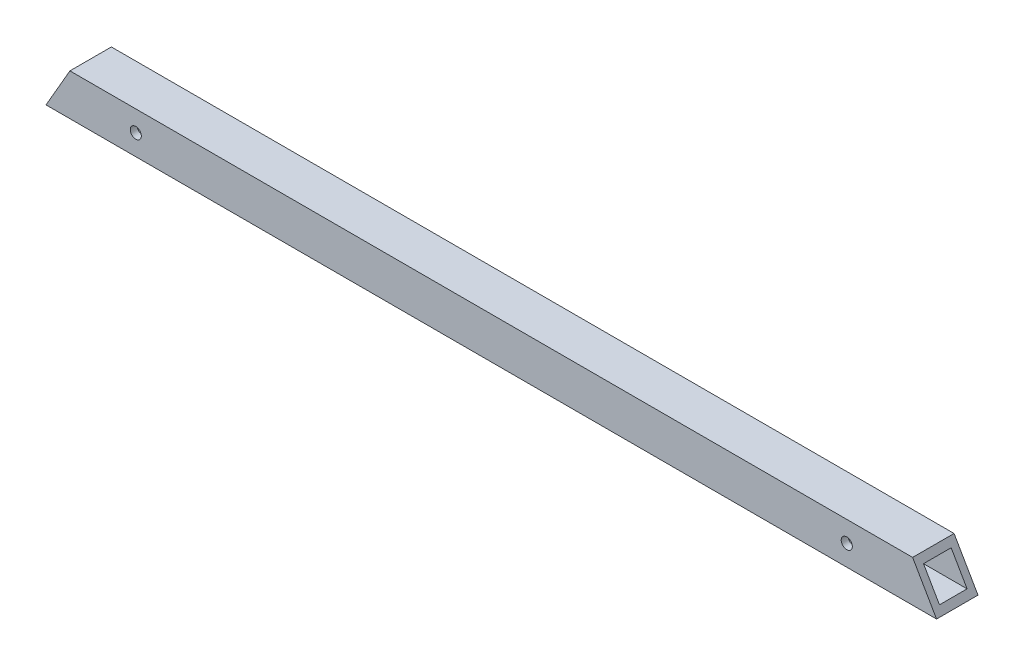
ISO-10303-21;
HEADER;
FILE_DESCRIPTION(('STEP AP214'),'2;1');
FILE_NAME('part.step','',(''),(''),'','','');
FILE_SCHEMA(('AUTOMOTIVE_DESIGN { 1 0 10303 214 1 1 1 1 }'));
ENDSEC;
DATA;
#1=APPLICATION_CONTEXT('core data for automotive mechanical design processes');
#2=APPLICATION_PROTOCOL_DEFINITION('international standard','automotive_design',2000,#1);
#3=PRODUCT_CONTEXT('',#1,'mechanical');
#4=PRODUCT('Part','Part','',(#3));
#5=PRODUCT_RELATED_PRODUCT_CATEGORY('part','',(#4));
#6=PRODUCT_DEFINITION_FORMATION('','',#4);
#7=PRODUCT_DEFINITION_CONTEXT('part definition',#1,'design');
#8=PRODUCT_DEFINITION('design','',#6,#7);
#9=PRODUCT_DEFINITION_SHAPE('','',#8);
#10=(LENGTH_UNIT() NAMED_UNIT(*) SI_UNIT(.MILLI.,.METRE.));
#11=(NAMED_UNIT(*) PLANE_ANGLE_UNIT() SI_UNIT($,.RADIAN.));
#12=(NAMED_UNIT(*) SI_UNIT($,.STERADIAN.) SOLID_ANGLE_UNIT());
#13=UNCERTAINTY_MEASURE_WITH_UNIT(LENGTH_MEASURE(1.E-05),#10,'distance_accuracy_value','');
#14=(GEOMETRIC_REPRESENTATION_CONTEXT(3) GLOBAL_UNCERTAINTY_ASSIGNED_CONTEXT((#13)) GLOBAL_UNIT_ASSIGNED_CONTEXT((#10,
#11,#12)) REPRESENTATION_CONTEXT('',''));
#15=CARTESIAN_POINT('',(0.,0.,0.));
#16=DIRECTION('',(0.,0.,1.));
#17=DIRECTION('',(1.,0.,0.));
#18=AXIS2_PLACEMENT_3D('',#15,#16,#17);
#19=CARTESIAN_POINT('',(431.8,0.,0.));
#20=DIRECTION('',(0.,0.,-1.));
#21=DIRECTION('',(-1.,0.,0.));
#22=AXIS2_PLACEMENT_3D('',#19,#20,#21);
#23=PLANE('',#22);
#24=CARTESIAN_POINT('',(368.072045256125,9.525,0.));
#25=DIRECTION('',(0.,0.,1.));
#26=DIRECTION('',(1.,0.,0.));
#27=AXIS2_PLACEMENT_3D('',#24,#25,#26);
#28=CIRCLE('',#27,2.55269999999996);
#29=CARTESIAN_POINT('',(370.624745256125,9.525,0.));
#30=VERTEX_POINT('',#29);
#31=EDGE_CURVE('E225',#30,#30,#28,.T.);
#32=ORIENTED_EDGE('',*,*,#31,.F.);
#33=EDGE_LOOP('',(#32));
#34=FACE_BOUND('',#33,.T.);
#35=CARTESIAN_POINT('',(41.275,9.525,0.));
#36=DIRECTION('',(0.,0.,1.));
#37=DIRECTION('',(1.,0.,0.));
#38=AXIS2_PLACEMENT_3D('',#35,#36,#37);
#39=CIRCLE('',#38,2.55269999999998);
#40=CARTESIAN_POINT('',(43.8277,9.525,0.));
#41=VERTEX_POINT('',#40);
#42=EDGE_CURVE('E140',#41,#41,#39,.T.);
#43=ORIENTED_EDGE('',*,*,#42,.F.);
#44=EDGE_LOOP('',(#43));
#45=FACE_BOUND('',#44,.T.);
#46=DIRECTION('',(-1.,0.,0.));
#47=VECTOR('',#46,1.);
#48=CARTESIAN_POINT('',(431.8,19.05,0.));
#49=LINE('',#48,#47);
#50=CARTESIAN_POINT('',(398.348522628062,19.05,0.));
#51=VERTEX_POINT('',#50);
#52=CARTESIAN_POINT('',(10.9985226280622,19.05,0.));
#53=VERTEX_POINT('',#52);
#54=EDGE_CURVE('E119',#51,#53,#49,.T.);
#55=ORIENTED_EDGE('',*,*,#54,.T.);
#56=DIRECTION('',(0.499999999999995,0.866025403784442,0.));
#57=VECTOR('',#56,1.);
#58=CARTESIAN_POINT('',(0.,0.,0.));
#59=LINE('',#58,#57);
#60=CARTESIAN_POINT('',(0.,0.,0.));
#61=VERTEX_POINT('',#60);
#62=EDGE_CURVE('E49',#61,#53,#59,.T.);
#63=ORIENTED_EDGE('',*,*,#62,.F.);
#64=DIRECTION('',(-1.,0.,0.));
#65=VECTOR('',#64,1.);
#66=CARTESIAN_POINT('',(431.8,0.,0.));
#67=LINE('',#66,#65);
#68=CARTESIAN_POINT('',(409.347045256125,0.,0.));
#69=VERTEX_POINT('',#68);
#70=EDGE_CURVE('E113',#69,#61,#67,.T.);
#71=ORIENTED_EDGE('',*,*,#70,.F.);
#72=DIRECTION('',(0.5,-0.866025403784439,0.));
#73=VECTOR('',#72,1.);
#74=CARTESIAN_POINT('',(307.010283942094,177.252470077951,0.));
#75=LINE('',#74,#73);
#76=EDGE_CURVE('E156',#51,#69,#75,.T.);
#77=ORIENTED_EDGE('',*,*,#76,.F.);
#78=EDGE_LOOP('',(#55,#63,#71,#77));
#79=FACE_BOUND('',#78,.T.);
#80=ADVANCED_FACE('F33',(#34,#45,#79),#23,.F.);
#81=CARTESIAN_POINT('',(431.8,0.,0.));
#82=DIRECTION('',(0.,1.,0.));
#83=DIRECTION('',(0.,0.,1.));
#84=AXIS2_PLACEMENT_3D('',#81,#82,#83);
#85=PLANE('',#84);
#86=DIRECTION('',(-1.,0.,0.));
#87=VECTOR('',#86,1.);
#88=CARTESIAN_POINT('',(431.8,0.,-19.05));
#89=LINE('',#88,#87);
#90=CARTESIAN_POINT('',(409.347045256125,0.,-19.05));
#91=VERTEX_POINT('',#90);
#92=CARTESIAN_POINT('',(0.,0.,-19.05));
#93=VERTEX_POINT('',#92);
#94=EDGE_CURVE('E108',#91,#93,#89,.T.);
#95=ORIENTED_EDGE('',*,*,#94,.F.);
#96=DIRECTION('',(0.,0.,1.));
#97=VECTOR('',#96,1.);
#98=CARTESIAN_POINT('',(409.347045256125,0.,-19.05));
#99=LINE('',#98,#97);
#100=EDGE_CURVE('E160',#91,#69,#99,.T.);
#101=ORIENTED_EDGE('',*,*,#100,.T.);
#102=ORIENTED_EDGE('',*,*,#70,.T.);
#103=DIRECTION('',(0.,0.,-1.));
#104=VECTOR('',#103,1.);
#105=CARTESIAN_POINT('',(0.,0.,0.));
#106=LINE('',#105,#104);
#107=EDGE_CURVE('E100',#61,#93,#106,.T.);
#108=ORIENTED_EDGE('',*,*,#107,.T.);
#109=EDGE_LOOP('',(#95,#101,#102,#108));
#110=FACE_BOUND('',#109,.T.);
#111=ADVANCED_FACE('F117',(#110),#85,.F.);
#112=CARTESIAN_POINT('',(431.8,0.,-19.05));
#113=DIRECTION('',(0.,0.,1.));
#114=DIRECTION('',(1.,0.,0.));
#115=AXIS2_PLACEMENT_3D('',#112,#113,#114);
#116=PLANE('',#115);
#117=CARTESIAN_POINT('',(368.072045256125,9.525,-19.05));
#118=DIRECTION('',(0.,0.,1.));
#119=DIRECTION('',(1.,0.,0.));
#120=AXIS2_PLACEMENT_3D('',#117,#118,#119);
#121=CIRCLE('',#120,2.55270000000002);
#122=CARTESIAN_POINT('',(370.624745256125,9.525,-19.05));
#123=VERTEX_POINT('',#122);
#124=EDGE_CURVE('E300',#123,#123,#121,.T.);
#125=ORIENTED_EDGE('',*,*,#124,.T.);
#126=EDGE_LOOP('',(#125));
#127=FACE_BOUND('',#126,.T.);
#128=CARTESIAN_POINT('',(41.275,9.525,-19.05));
#129=DIRECTION('',(0.,0.,1.));
#130=DIRECTION('',(1.,0.,0.));
#131=AXIS2_PLACEMENT_3D('',#128,#129,#130);
#132=CIRCLE('',#131,2.5527);
#133=CARTESIAN_POINT('',(43.8277,9.525,-19.05));
#134=VERTEX_POINT('',#133);
#135=EDGE_CURVE('E134',#134,#134,#132,.T.);
#136=ORIENTED_EDGE('',*,*,#135,.T.);
#137=EDGE_LOOP('',(#136));
#138=FACE_BOUND('',#137,.T.);
#139=ORIENTED_EDGE('',*,*,#94,.T.);
#140=DIRECTION('',(0.499999999999995,0.866025403784442,0.));
#141=VECTOR('',#140,1.);
#142=CARTESIAN_POINT('',(0.,0.,-19.05));
#143=LINE('',#142,#141);
#144=CARTESIAN_POINT('',(10.9985226280622,19.05,-19.05));
#145=VERTEX_POINT('',#144);
#146=EDGE_CURVE('E96',#93,#145,#143,.T.);
#147=ORIENTED_EDGE('',*,*,#146,.T.);
#148=DIRECTION('',(-1.,0.,0.));
#149=VECTOR('',#148,1.);
#150=CARTESIAN_POINT('',(431.8,19.05,-19.05));
#151=LINE('',#150,#149);
#152=CARTESIAN_POINT('',(398.348522628062,19.05,-19.05));
#153=VERTEX_POINT('',#152);
#154=EDGE_CURVE('E114',#153,#145,#151,.T.);
#155=ORIENTED_EDGE('',*,*,#154,.F.);
#156=DIRECTION('',(0.5,-0.866025403784439,0.));
#157=VECTOR('',#156,1.);
#158=CARTESIAN_POINT('',(307.010283942094,177.252470077951,-19.05));
#159=LINE('',#158,#157);
#160=EDGE_CURVE('E110',#153,#91,#159,.T.);
#161=ORIENTED_EDGE('',*,*,#160,.T.);
#162=EDGE_LOOP('',(#139,#147,#155,#161));
#163=FACE_BOUND('',#162,.T.);
#164=ADVANCED_FACE('F109',(#127,#138,#163),#116,.F.);
#165=CARTESIAN_POINT('',(431.8,19.05,0.));
#166=DIRECTION('',(0.,-1.,0.));
#167=DIRECTION('',(0.,0.,-1.));
#168=AXIS2_PLACEMENT_3D('',#165,#166,#167);
#169=PLANE('',#168);
#170=ORIENTED_EDGE('',*,*,#154,.T.);
#171=DIRECTION('',(0.,0.,1.));
#172=VECTOR('',#171,1.);
#173=CARTESIAN_POINT('',(10.9985226280622,19.05,-19.05));
#174=LINE('',#173,#172);
#175=EDGE_CURVE('E101',#145,#53,#174,.T.);
#176=ORIENTED_EDGE('',*,*,#175,.T.);
#177=ORIENTED_EDGE('',*,*,#54,.F.);
#178=DIRECTION('',(0.,0.,1.));
#179=VECTOR('',#178,1.);
#180=CARTESIAN_POINT('',(398.348522628062,19.05,-19.05));
#181=LINE('',#180,#179);
#182=EDGE_CURVE('E158',#153,#51,#181,.T.);
#183=ORIENTED_EDGE('',*,*,#182,.F.);
#184=EDGE_LOOP('',(#170,#176,#177,#183));
#185=FACE_BOUND('',#184,.T.);
#186=ADVANCED_FACE('F203',(#185),#169,.F.);
#187=CARTESIAN_POINT('',(431.8,3.175,-3.175));
#188=DIRECTION('',(0.,0.,-1.));
#189=DIRECTION('',(0.,1.,0.));
#190=AXIS2_PLACEMENT_3D('',#187,#188,#189);
#191=PLANE('',#190);
#192=CARTESIAN_POINT('',(368.072045256125,9.525,-3.175));
#193=DIRECTION('',(0.,0.,-1.));
#194=DIRECTION('',(0.,1.,0.));
#195=AXIS2_PLACEMENT_3D('',#192,#193,#194);
#196=CIRCLE('',#195,2.55269999999999);
#197=CARTESIAN_POINT('',(368.072045256125,12.0777,-3.175));
#198=VERTEX_POINT('',#197);
#199=EDGE_CURVE('E145',#198,#198,#196,.T.);
#200=ORIENTED_EDGE('',*,*,#199,.F.);
#201=EDGE_LOOP('',(#200));
#202=FACE_BOUND('',#201,.T.);
#203=CARTESIAN_POINT('',(41.275,9.525,-3.175));
#204=DIRECTION('',(0.,0.,-1.));
#205=DIRECTION('',(0.,1.,0.));
#206=AXIS2_PLACEMENT_3D('',#203,#204,#205);
#207=CIRCLE('',#206,2.55269999999999);
#208=CARTESIAN_POINT('',(41.275,12.0777,-3.175));
#209=VERTEX_POINT('',#208);
#210=EDGE_CURVE('E133',#209,#209,#207,.T.);
#211=ORIENTED_EDGE('',*,*,#210,.F.);
#212=EDGE_LOOP('',(#211));
#213=FACE_BOUND('',#212,.T.);
#214=DIRECTION('',(-0.499999999999995,-0.866025403784442,0.));
#215=VECTOR('',#214,1.);
#216=CARTESIAN_POINT('',(109.324815328506,189.356134677059,-3.17500000000001));
#217=LINE('',#216,#215);
#218=CARTESIAN_POINT('',(9.16543552338522,15.875,-3.175));
#219=VERTEX_POINT('',#218);
#220=CARTESIAN_POINT('',(1.83308710467706,3.175,-3.175));
#221=VERTEX_POINT('',#220);
#222=EDGE_CURVE('E154',#219,#221,#217,.T.);
#223=ORIENTED_EDGE('',*,*,#222,.F.);
#224=DIRECTION('',(-1.,0.,0.));
#225=VECTOR('',#224,1.);
#226=CARTESIAN_POINT('',(431.8,15.875,-3.175));
#227=LINE('',#226,#225);
#228=CARTESIAN_POINT('',(400.181609732739,15.875,-3.175));
#229=VERTEX_POINT('',#228);
#230=EDGE_CURVE('E169',#229,#219,#227,.T.);
#231=ORIENTED_EDGE('',*,*,#230,.F.);
#232=DIRECTION('',(-0.5,0.866025403784439,0.));
#233=VECTOR('',#232,1.);
#234=CARTESIAN_POINT('',(413.585468613586,-7.34116459910921,-3.175));
#235=LINE('',#234,#233);
#236=CARTESIAN_POINT('',(407.513958151447,3.175,-3.175));
#237=VERTEX_POINT('',#236);
#238=EDGE_CURVE('E167',#237,#229,#235,.T.);
#239=ORIENTED_EDGE('',*,*,#238,.F.);
#240=DIRECTION('',(-1.,0.,0.));
#241=VECTOR('',#240,1.);
#242=CARTESIAN_POINT('',(431.8,3.175,-3.175));
#243=LINE('',#242,#241);
#244=EDGE_CURVE('E120',#237,#221,#243,.T.);
#245=ORIENTED_EDGE('',*,*,#244,.T.);
#246=EDGE_LOOP('',(#223,#231,#239,#245));
#247=FACE_BOUND('',#246,.T.);
#248=ADVANCED_FACE('F191',(#202,#213,#247),#191,.T.);
#249=CARTESIAN_POINT('',(431.8,3.175,-3.175));
#250=DIRECTION('',(0.,1.,0.));
#251=DIRECTION('',(0.,0.,1.));
#252=AXIS2_PLACEMENT_3D('',#249,#250,#251);
#253=PLANE('',#252);
#254=DIRECTION('',(0.,0.,-1.));
#255=VECTOR('',#254,1.);
#256=CARTESIAN_POINT('',(1.83308710467706,3.175,-3.175));
#257=LINE('',#256,#255);
#258=CARTESIAN_POINT('',(1.83308710467704,3.17500000000001,-15.875));
#259=VERTEX_POINT('',#258);
#260=EDGE_CURVE('E152',#221,#259,#257,.T.);
#261=ORIENTED_EDGE('',*,*,#260,.F.);
#262=ORIENTED_EDGE('',*,*,#244,.F.);
#263=DIRECTION('',(0.,0.,1.));
#264=VECTOR('',#263,1.);
#265=CARTESIAN_POINT('',(407.513958151447,3.175,-3.175));
#266=LINE('',#265,#264);
#267=CARTESIAN_POINT('',(407.513958151447,3.175,-15.875));
#268=VERTEX_POINT('',#267);
#269=EDGE_CURVE('E165',#268,#237,#266,.T.);
#270=ORIENTED_EDGE('',*,*,#269,.F.);
#271=DIRECTION('',(-1.,0.,0.));
#272=VECTOR('',#271,1.);
#273=CARTESIAN_POINT('',(431.8,3.175,-15.875));
#274=LINE('',#273,#272);
#275=EDGE_CURVE('E125',#268,#259,#274,.T.);
#276=ORIENTED_EDGE('',*,*,#275,.T.);
#277=EDGE_LOOP('',(#261,#262,#270,#276));
#278=FACE_BOUND('',#277,.T.);
#279=ADVANCED_FACE('F179',(#278),#253,.T.);
#280=CARTESIAN_POINT('',(431.8,3.175,-15.875));
#281=DIRECTION('',(0.,0.,1.));
#282=DIRECTION('',(1.,0.,0.));
#283=AXIS2_PLACEMENT_3D('',#280,#281,#282);
#284=PLANE('',#283);
#285=CARTESIAN_POINT('',(368.072045256125,9.525,-15.875));
#286=DIRECTION('',(0.,0.,1.));
#287=DIRECTION('',(1.,0.,0.));
#288=AXIS2_PLACEMENT_3D('',#285,#286,#287);
#289=CIRCLE('',#288,2.55269999999999);
#290=CARTESIAN_POINT('',(370.624745256125,9.525,-15.875));
#291=VERTEX_POINT('',#290);
#292=EDGE_CURVE('E36',#291,#291,#289,.T.);
#293=ORIENTED_EDGE('',*,*,#292,.F.);
#294=EDGE_LOOP('',(#293));
#295=FACE_BOUND('',#294,.T.);
#296=CARTESIAN_POINT('',(41.275,9.525,-15.875));
#297=DIRECTION('',(0.,0.,1.));
#298=DIRECTION('',(1.,0.,0.));
#299=AXIS2_PLACEMENT_3D('',#296,#297,#298);
#300=CIRCLE('',#299,2.55269999999999);
#301=CARTESIAN_POINT('',(43.8277,9.525,-15.875));
#302=VERTEX_POINT('',#301);
#303=EDGE_CURVE('E131',#302,#302,#300,.T.);
#304=ORIENTED_EDGE('',*,*,#303,.F.);
#305=EDGE_LOOP('',(#304));
#306=FACE_BOUND('',#305,.T.);
#307=DIRECTION('',(0.499999999999995,0.866025403784442,0.));
#308=VECTOR('',#307,1.);
#309=CARTESIAN_POINT('',(109.324815328506,189.356134677059,-15.875));
#310=LINE('',#309,#308);
#311=CARTESIAN_POINT('',(9.16543552338522,15.875,-15.875));
#312=VERTEX_POINT('',#311);
#313=EDGE_CURVE('E56',#259,#312,#310,.T.);
#314=ORIENTED_EDGE('',*,*,#313,.F.);
#315=ORIENTED_EDGE('',*,*,#275,.F.);
#316=DIRECTION('',(0.5,-0.866025403784439,0.));
#317=VECTOR('',#316,1.);
#318=CARTESIAN_POINT('',(413.585468613586,-7.34116459910921,-15.875));
#319=LINE('',#318,#317);
#320=CARTESIAN_POINT('',(400.181609732739,15.875,-15.875));
#321=VERTEX_POINT('',#320);
#322=EDGE_CURVE('E162',#321,#268,#319,.T.);
#323=ORIENTED_EDGE('',*,*,#322,.F.);
#324=DIRECTION('',(-1.,0.,0.));
#325=VECTOR('',#324,1.);
#326=CARTESIAN_POINT('',(431.8,15.875,-15.875));
#327=LINE('',#326,#325);
#328=EDGE_CURVE('E172',#321,#312,#327,.T.);
#329=ORIENTED_EDGE('',*,*,#328,.T.);
#330=EDGE_LOOP('',(#314,#315,#323,#329));
#331=FACE_BOUND('',#330,.T.);
#332=ADVANCED_FACE('F183',(#295,#306,#331),#284,.T.);
#333=CARTESIAN_POINT('',(431.8,15.875,-3.175));
#334=DIRECTION('',(0.,-1.,0.));
#335=DIRECTION('',(0.,0.,-1.));
#336=AXIS2_PLACEMENT_3D('',#333,#334,#335);
#337=PLANE('',#336);
#338=DIRECTION('',(0.,0.,1.));
#339=VECTOR('',#338,1.);
#340=CARTESIAN_POINT('',(9.16543552338522,15.875,-3.175));
#341=LINE('',#340,#339);
#342=EDGE_CURVE('E11',#312,#219,#341,.T.);
#343=ORIENTED_EDGE('',*,*,#342,.F.);
#344=ORIENTED_EDGE('',*,*,#328,.F.);
#345=DIRECTION('',(0.,0.,-1.));
#346=VECTOR('',#345,1.);
#347=CARTESIAN_POINT('',(400.181609732739,15.875,-3.175));
#348=LINE('',#347,#346);
#349=EDGE_CURVE('E41',#229,#321,#348,.T.);
#350=ORIENTED_EDGE('',*,*,#349,.F.);
#351=ORIENTED_EDGE('',*,*,#230,.T.);
#352=EDGE_LOOP('',(#343,#344,#350,#351));
#353=FACE_BOUND('',#352,.T.);
#354=ADVANCED_FACE('F187',(#353),#337,.T.);
#355=CARTESIAN_POINT('',(307.010283942094,177.252470077951,-19.05));
#356=DIRECTION('',(-0.866025403784439,-0.5,0.));
#357=DIRECTION('',(0.5,-0.866025403784439,0.));
#358=AXIS2_PLACEMENT_3D('',#355,#356,#357);
#359=PLANE('',#358);
#360=ORIENTED_EDGE('',*,*,#238,.T.);
#361=ORIENTED_EDGE('',*,*,#349,.T.);
#362=ORIENTED_EDGE('',*,*,#322,.T.);
#363=ORIENTED_EDGE('',*,*,#269,.T.);
#364=EDGE_LOOP('',(#360,#361,#362,#363));
#365=FACE_BOUND('',#364,.T.);
#366=ORIENTED_EDGE('',*,*,#76,.T.);
#367=ORIENTED_EDGE('',*,*,#100,.F.);
#368=ORIENTED_EDGE('',*,*,#160,.F.);
#369=ORIENTED_EDGE('',*,*,#182,.T.);
#370=EDGE_LOOP('',(#366,#367,#368,#369));
#371=FACE_BOUND('',#370,.T.);
#372=ADVANCED_FACE('F194',(#365,#371),#359,.F.);
#373=CARTESIAN_POINT('',(0.,0.,-19.05));
#374=DIRECTION('',(0.866025403784442,-0.499999999999995,0.));
#375=DIRECTION('',(0.499999999999995,0.866025403784442,0.));
#376=AXIS2_PLACEMENT_3D('',#373,#374,#375);
#377=PLANE('',#376);
#378=ORIENTED_EDGE('',*,*,#222,.T.);
#379=ORIENTED_EDGE('',*,*,#260,.T.);
#380=ORIENTED_EDGE('',*,*,#313,.T.);
#381=ORIENTED_EDGE('',*,*,#342,.T.);
#382=EDGE_LOOP('',(#378,#379,#380,#381));
#383=FACE_BOUND('',#382,.T.);
#384=ORIENTED_EDGE('',*,*,#62,.T.);
#385=ORIENTED_EDGE('',*,*,#175,.F.);
#386=ORIENTED_EDGE('',*,*,#146,.F.);
#387=ORIENTED_EDGE('',*,*,#107,.F.);
#388=EDGE_LOOP('',(#384,#385,#386,#387));
#389=FACE_BOUND('',#388,.T.);
#390=ADVANCED_FACE('F98',(#383,#389),#377,.F.);
#391=CARTESIAN_POINT('',(41.275,9.525,0.));
#392=DIRECTION('',(0.,0.,1.));
#393=DIRECTION('',(1.,0.,0.));
#394=AXIS2_PLACEMENT_3D('',#391,#392,#393);
#395=CYLINDRICAL_SURFACE('',#394,2.55269999999999);
#396=ORIENTED_EDGE('',*,*,#303,.T.);
#397=EDGE_LOOP('',(#396));
#398=FACE_BOUND('',#397,.T.);
#399=ORIENTED_EDGE('',*,*,#135,.F.);
#400=EDGE_LOOP('',(#399));
#401=FACE_BOUND('',#400,.T.);
#402=ADVANCED_FACE('F231',(#398,#401),#395,.F.);
#403=ORIENTED_EDGE('',*,*,#210,.T.);
#404=EDGE_LOOP('',(#403));
#405=FACE_BOUND('',#404,.T.);
#406=ORIENTED_EDGE('',*,*,#42,.T.);
#407=EDGE_LOOP('',(#406));
#408=FACE_BOUND('',#407,.T.);
#409=ADVANCED_FACE('F228',(#405,#408),#395,.F.);
#410=CARTESIAN_POINT('',(368.072045256125,9.525,0.));
#411=DIRECTION('',(0.,0.,1.));
#412=DIRECTION('',(1.,0.,0.));
#413=AXIS2_PLACEMENT_3D('',#410,#411,#412);
#414=CYLINDRICAL_SURFACE('',#413,2.55269999999999);
#415=ORIENTED_EDGE('',*,*,#292,.T.);
#416=EDGE_LOOP('',(#415));
#417=FACE_BOUND('',#416,.T.);
#418=ORIENTED_EDGE('',*,*,#124,.F.);
#419=EDGE_LOOP('',(#418));
#420=FACE_BOUND('',#419,.T.);
#421=ADVANCED_FACE('F230',(#417,#420),#414,.F.);
#422=ORIENTED_EDGE('',*,*,#199,.T.);
#423=EDGE_LOOP('',(#422));
#424=FACE_BOUND('',#423,.T.);
#425=ORIENTED_EDGE('',*,*,#31,.T.);
#426=EDGE_LOOP('',(#425));
#427=FACE_BOUND('',#426,.T.);
#428=ADVANCED_FACE('F238',(#424,#427),#414,.F.);
#429=CLOSED_SHELL('',(#80,#111,#164,#186,#248,#279,#332,#354,#372,#390,#402,#409,#421,#428));
#430=MANIFOLD_SOLID_BREP('B2',#429);
#431=ADVANCED_BREP_SHAPE_REPRESENTATION('',(#18,#430),#14);
#432=SHAPE_DEFINITION_REPRESENTATION(#9,#431);
ENDSEC;
END-ISO-10303-21;
